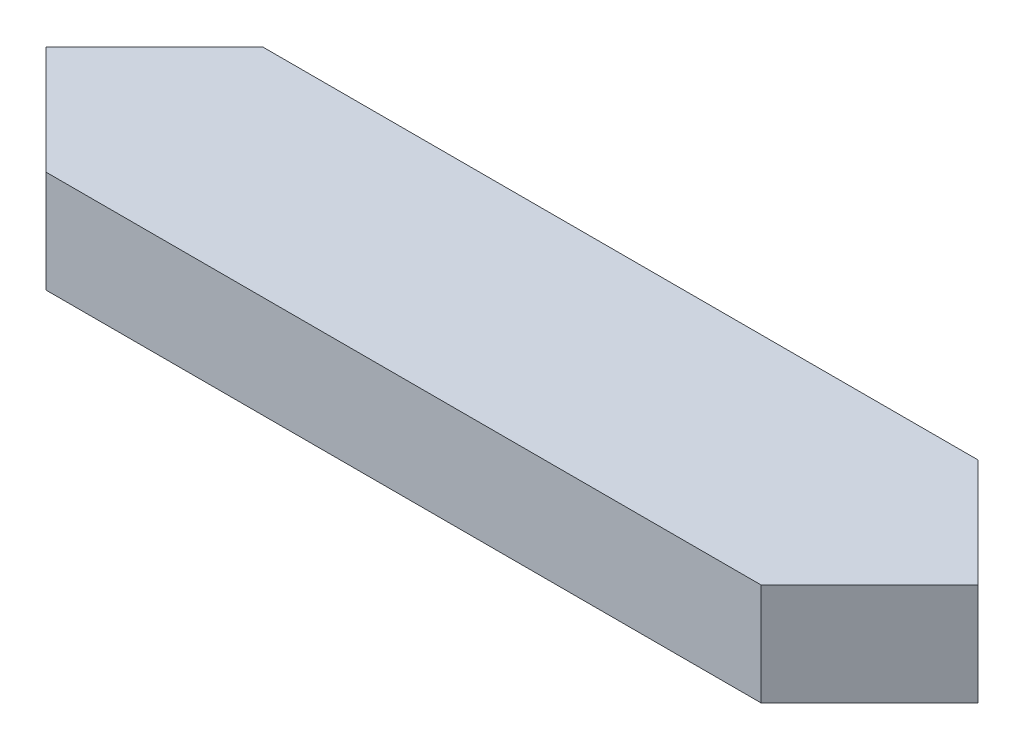
ISO-10303-21;
HEADER;
FILE_DESCRIPTION(('STEP AP214'),'2;1');
FILE_NAME('part.step','',(''),(''),'','','');
FILE_SCHEMA(('AUTOMOTIVE_DESIGN { 1 0 10303 214 1 1 1 1 }'));
ENDSEC;
DATA;
#1=APPLICATION_CONTEXT('core data for automotive mechanical design processes');
#2=APPLICATION_PROTOCOL_DEFINITION('international standard','automotive_design',2000,#1);
#3=PRODUCT_CONTEXT('',#1,'mechanical');
#4=PRODUCT('Part','Part','',(#3));
#5=PRODUCT_RELATED_PRODUCT_CATEGORY('part','',(#4));
#6=PRODUCT_DEFINITION_FORMATION('','',#4);
#7=PRODUCT_DEFINITION_CONTEXT('part definition',#1,'design');
#8=PRODUCT_DEFINITION('design','',#6,#7);
#9=PRODUCT_DEFINITION_SHAPE('','',#8);
#10=(LENGTH_UNIT() NAMED_UNIT(*) SI_UNIT(.MILLI.,.METRE.));
#11=(NAMED_UNIT(*) PLANE_ANGLE_UNIT() SI_UNIT($,.RADIAN.));
#12=(NAMED_UNIT(*) SI_UNIT($,.STERADIAN.) SOLID_ANGLE_UNIT());
#13=UNCERTAINTY_MEASURE_WITH_UNIT(LENGTH_MEASURE(1.E-05),#10,'distance_accuracy_value','');
#14=(GEOMETRIC_REPRESENTATION_CONTEXT(3) GLOBAL_UNCERTAINTY_ASSIGNED_CONTEXT((#13)) GLOBAL_UNIT_ASSIGNED_CONTEXT((#10,
#11,#12)) REPRESENTATION_CONTEXT('',''));
#15=CARTESIAN_POINT('',(0.,0.,0.));
#16=DIRECTION('',(0.,0.,1.));
#17=DIRECTION('',(1.,0.,0.));
#18=AXIS2_PLACEMENT_3D('',#15,#16,#17);
#19=CARTESIAN_POINT('',(0.,0.254,0.));
#20=DIRECTION('',(0.707106781186548,0.,-0.707106781186548));
#21=DIRECTION('',(-0.707106781186548,0.,-0.707106781186548));
#22=AXIS2_PLACEMENT_3D('',#19,#20,#21);
#23=PLANE('',#22);
#24=DIRECTION('',(0.707106781186547,0.,0.707106781186547));
#25=VECTOR('',#24,1.);
#26=CARTESIAN_POINT('',(0.,0.,0.));
#27=LINE('',#26,#25);
#28=CARTESIAN_POINT('',(0.,0.,0.));
#29=VERTEX_POINT('',#28);
#30=CARTESIAN_POINT('',(0.269407683632075,0.,0.269407683632075));
#31=VERTEX_POINT('',#30);
#32=EDGE_CURVE('E128',#29,#31,#27,.T.);
#33=ORIENTED_EDGE('',*,*,#32,.T.);
#34=DIRECTION('',(0.,-1.,0.));
#35=VECTOR('',#34,1.);
#36=CARTESIAN_POINT('',(0.269407683632075,0.254,0.269407683632075));
#37=LINE('',#36,#35);
#38=CARTESIAN_POINT('',(0.269407683632075,0.254,0.269407683632075));
#39=VERTEX_POINT('',#38);
#40=EDGE_CURVE('E11',#39,#31,#37,.T.);
#41=ORIENTED_EDGE('',*,*,#40,.F.);
#42=DIRECTION('',(0.707106781186547,0.,0.707106781186547));
#43=VECTOR('',#42,1.);
#44=CARTESIAN_POINT('',(0.,0.254,0.));
#45=LINE('',#44,#43);
#46=CARTESIAN_POINT('',(0.,0.254,0.));
#47=VERTEX_POINT('',#46);
#48=EDGE_CURVE('E144',#47,#39,#45,.T.);
#49=ORIENTED_EDGE('',*,*,#48,.F.);
#50=DIRECTION('',(0.,-1.,0.));
#51=VECTOR('',#50,1.);
#52=CARTESIAN_POINT('',(0.,0.254,0.));
#53=LINE('',#52,#51);
#54=EDGE_CURVE('E124',#47,#29,#53,.T.);
#55=ORIENTED_EDGE('',*,*,#54,.T.);
#56=EDGE_LOOP('',(#33,#41,#49,#55));
#57=FACE_BOUND('',#56,.T.);
#58=ADVANCED_FACE('F39',(#57),#23,.F.);
#59=CARTESIAN_POINT('',(0.269407683632075,0.254,0.269407683632075));
#60=DIRECTION('',(0.,0.,-1.));
#61=DIRECTION('',(-1.,0.,0.));
#62=AXIS2_PLACEMENT_3D('',#59,#60,#61);
#63=PLANE('',#62);
#64=DIRECTION('',(1.,0.,0.));
#65=VECTOR('',#64,1.);
#66=CARTESIAN_POINT('',(0.269407683632075,0.,0.269407683632075));
#67=LINE('',#66,#65);
#68=CARTESIAN_POINT('',(2.04740768363207,0.,0.269407683632075));
#69=VERTEX_POINT('',#68);
#70=EDGE_CURVE('E132',#31,#69,#67,.T.);
#71=ORIENTED_EDGE('',*,*,#70,.T.);
#72=DIRECTION('',(0.,-1.,0.));
#73=VECTOR('',#72,1.);
#74=CARTESIAN_POINT('',(2.04740768363207,0.254,0.269407683632075));
#75=LINE('',#74,#73);
#76=CARTESIAN_POINT('',(2.04740768363207,0.254,0.269407683632075));
#77=VERTEX_POINT('',#76);
#78=EDGE_CURVE('E48',#77,#69,#75,.T.);
#79=ORIENTED_EDGE('',*,*,#78,.F.);
#80=DIRECTION('',(1.,0.,0.));
#81=VECTOR('',#80,1.);
#82=CARTESIAN_POINT('',(0.269407683632075,0.254,0.269407683632075));
#83=LINE('',#82,#81);
#84=EDGE_CURVE('E93',#39,#77,#83,.T.);
#85=ORIENTED_EDGE('',*,*,#84,.F.);
#86=ORIENTED_EDGE('',*,*,#40,.T.);
#87=EDGE_LOOP('',(#71,#79,#85,#86));
#88=FACE_BOUND('',#87,.T.);
#89=ADVANCED_FACE('F172',(#88),#63,.F.);
#90=CARTESIAN_POINT('',(2.04740768363207,0.254,0.269407683632075));
#91=DIRECTION('',(-0.707106781186548,0.,-0.707106781186547));
#92=DIRECTION('',(-0.707106781186547,0.,0.707106781186548));
#93=AXIS2_PLACEMENT_3D('',#90,#91,#92);
#94=PLANE('',#93);
#95=DIRECTION('',(0.707106781186547,0.,-0.707106781186548));
#96=VECTOR('',#95,1.);
#97=CARTESIAN_POINT('',(2.04740768363207,0.,0.269407683632075));
#98=LINE('',#97,#96);
#99=CARTESIAN_POINT('',(2.31681536726415,0.,0.));
#100=VERTEX_POINT('',#99);
#101=EDGE_CURVE('E135',#69,#100,#98,.T.);
#102=ORIENTED_EDGE('',*,*,#101,.T.);
#103=DIRECTION('',(0.,-1.,0.));
#104=VECTOR('',#103,1.);
#105=CARTESIAN_POINT('',(2.31681536726415,0.254,0.));
#106=LINE('',#105,#104);
#107=CARTESIAN_POINT('',(2.31681536726415,0.254,0.));
#108=VERTEX_POINT('',#107);
#109=EDGE_CURVE('E117',#108,#100,#106,.T.);
#110=ORIENTED_EDGE('',*,*,#109,.F.);
#111=DIRECTION('',(0.707106781186547,0.,-0.707106781186548));
#112=VECTOR('',#111,1.);
#113=CARTESIAN_POINT('',(2.04740768363207,0.254,0.269407683632075));
#114=LINE('',#113,#112);
#115=EDGE_CURVE('E106',#77,#108,#114,.T.);
#116=ORIENTED_EDGE('',*,*,#115,.F.);
#117=ORIENTED_EDGE('',*,*,#78,.T.);
#118=EDGE_LOOP('',(#102,#110,#116,#117));
#119=FACE_BOUND('',#118,.T.);
#120=ADVANCED_FACE('F154',(#119),#94,.F.);
#121=CARTESIAN_POINT('',(2.04740768363207,0.254,-0.269407683632075));
#122=DIRECTION('',(-0.707106781186548,0.,0.707106781186547));
#123=DIRECTION('',(0.707106781186547,0.,0.707106781186548));
#124=AXIS2_PLACEMENT_3D('',#121,#122,#123);
#125=PLANE('',#124);
#126=DIRECTION('',(-0.707106781186547,0.,-0.707106781186548));
#127=VECTOR('',#126,1.);
#128=CARTESIAN_POINT('',(2.04740768363207,0.,-0.269407683632075));
#129=LINE('',#128,#127);
#130=CARTESIAN_POINT('',(2.04740768363207,0.,-0.269407683632075));
#131=VERTEX_POINT('',#130);
#132=EDGE_CURVE('E115',#100,#131,#129,.T.);
#133=ORIENTED_EDGE('',*,*,#132,.T.);
#134=DIRECTION('',(0.,-1.,0.));
#135=VECTOR('',#134,1.);
#136=CARTESIAN_POINT('',(2.04740768363207,0.254,-0.269407683632075));
#137=LINE('',#136,#135);
#138=CARTESIAN_POINT('',(2.04740768363207,0.254,-0.269407683632075));
#139=VERTEX_POINT('',#138);
#140=EDGE_CURVE('E112',#139,#131,#137,.T.);
#141=ORIENTED_EDGE('',*,*,#140,.F.);
#142=DIRECTION('',(-0.707106781186547,0.,-0.707106781186548));
#143=VECTOR('',#142,1.);
#144=CARTESIAN_POINT('',(2.04740768363207,0.254,-0.269407683632075));
#145=LINE('',#144,#143);
#146=EDGE_CURVE('E100',#108,#139,#145,.T.);
#147=ORIENTED_EDGE('',*,*,#146,.F.);
#148=ORIENTED_EDGE('',*,*,#109,.T.);
#149=EDGE_LOOP('',(#133,#141,#147,#148));
#150=FACE_BOUND('',#149,.T.);
#151=ADVANCED_FACE('F113',(#150),#125,.F.);
#152=CARTESIAN_POINT('',(0.269407683632075,0.254,-0.269407683632075));
#153=DIRECTION('',(0.,0.,1.));
#154=DIRECTION('',(1.,0.,0.));
#155=AXIS2_PLACEMENT_3D('',#152,#153,#154);
#156=PLANE('',#155);
#157=DIRECTION('',(-1.,0.,0.));
#158=VECTOR('',#157,1.);
#159=CARTESIAN_POINT('',(0.269407683632075,0.,-0.269407683632075));
#160=LINE('',#159,#158);
#161=CARTESIAN_POINT('',(0.269407683632075,0.,-0.269407683632075));
#162=VERTEX_POINT('',#161);
#163=EDGE_CURVE('E79',#131,#162,#160,.T.);
#164=ORIENTED_EDGE('',*,*,#163,.T.);
#165=DIRECTION('',(0.,-1.,0.));
#166=VECTOR('',#165,1.);
#167=CARTESIAN_POINT('',(0.269407683632075,0.254,-0.269407683632075));
#168=LINE('',#167,#166);
#169=CARTESIAN_POINT('',(0.269407683632075,0.254,-0.269407683632075));
#170=VERTEX_POINT('',#169);
#171=EDGE_CURVE('E118',#170,#162,#168,.T.);
#172=ORIENTED_EDGE('',*,*,#171,.F.);
#173=DIRECTION('',(-1.,0.,0.));
#174=VECTOR('',#173,1.);
#175=CARTESIAN_POINT('',(0.269407683632075,0.254,-0.269407683632075));
#176=LINE('',#175,#174);
#177=EDGE_CURVE('E104',#139,#170,#176,.T.);
#178=ORIENTED_EDGE('',*,*,#177,.F.);
#179=ORIENTED_EDGE('',*,*,#140,.T.);
#180=EDGE_LOOP('',(#164,#172,#178,#179));
#181=FACE_BOUND('',#180,.T.);
#182=ADVANCED_FACE('F120',(#181),#156,.F.);
#183=CARTESIAN_POINT('',(0.,0.254,0.));
#184=DIRECTION('',(0.707106781186548,0.,0.707106781186548));
#185=DIRECTION('',(0.707106781186548,0.,-0.707106781186548));
#186=AXIS2_PLACEMENT_3D('',#183,#184,#185);
#187=PLANE('',#186);
#188=DIRECTION('',(-0.707106781186547,0.,0.707106781186547));
#189=VECTOR('',#188,1.);
#190=CARTESIAN_POINT('',(0.,0.,0.));
#191=LINE('',#190,#189);
#192=EDGE_CURVE('E85',#162,#29,#191,.T.);
#193=ORIENTED_EDGE('',*,*,#192,.T.);
#194=ORIENTED_EDGE('',*,*,#54,.F.);
#195=DIRECTION('',(-0.707106781186547,0.,0.707106781186547));
#196=VECTOR('',#195,1.);
#197=CARTESIAN_POINT('',(0.,0.254,0.));
#198=LINE('',#197,#196);
#199=EDGE_CURVE('E56',#170,#47,#198,.T.);
#200=ORIENTED_EDGE('',*,*,#199,.F.);
#201=ORIENTED_EDGE('',*,*,#171,.T.);
#202=EDGE_LOOP('',(#193,#194,#200,#201));
#203=FACE_BOUND('',#202,.T.);
#204=ADVANCED_FACE('F161',(#203),#187,.F.);
#205=CARTESIAN_POINT('',(0.,0.254,0.));
#206=DIRECTION('',(0.,1.,0.));
#207=DIRECTION('',(0.,0.,1.));
#208=AXIS2_PLACEMENT_3D('',#205,#206,#207);
#209=PLANE('',#208);
#210=ORIENTED_EDGE('',*,*,#48,.T.);
#211=ORIENTED_EDGE('',*,*,#84,.T.);
#212=ORIENTED_EDGE('',*,*,#115,.T.);
#213=ORIENTED_EDGE('',*,*,#146,.T.);
#214=ORIENTED_EDGE('',*,*,#177,.T.);
#215=ORIENTED_EDGE('',*,*,#199,.T.);
#216=EDGE_LOOP('',(#210,#211,#212,#213,#214,#215));
#217=FACE_BOUND('',#216,.T.);
#218=ADVANCED_FACE('F102',(#217),#209,.T.);
#219=CARTESIAN_POINT('',(0.,0.,0.));
#220=DIRECTION('',(0.,1.,0.));
#221=DIRECTION('',(0.,0.,1.));
#222=AXIS2_PLACEMENT_3D('',#219,#220,#221);
#223=PLANE('',#222);
#224=ORIENTED_EDGE('',*,*,#32,.F.);
#225=ORIENTED_EDGE('',*,*,#192,.F.);
#226=ORIENTED_EDGE('',*,*,#163,.F.);
#227=ORIENTED_EDGE('',*,*,#132,.F.);
#228=ORIENTED_EDGE('',*,*,#101,.F.);
#229=ORIENTED_EDGE('',*,*,#70,.F.);
#230=EDGE_LOOP('',(#224,#225,#226,#227,#228,#229));
#231=FACE_BOUND('',#230,.T.);
#232=ADVANCED_FACE('F157',(#231),#223,.F.);
#233=CLOSED_SHELL('',(#58,#89,#120,#151,#182,#204,#218,#232));
#234=MANIFOLD_SOLID_BREP('B2',#233);
#235=ADVANCED_BREP_SHAPE_REPRESENTATION('',(#18,#234),#14);
#236=SHAPE_DEFINITION_REPRESENTATION(#9,#235);
ENDSEC;
END-ISO-10303-21;
